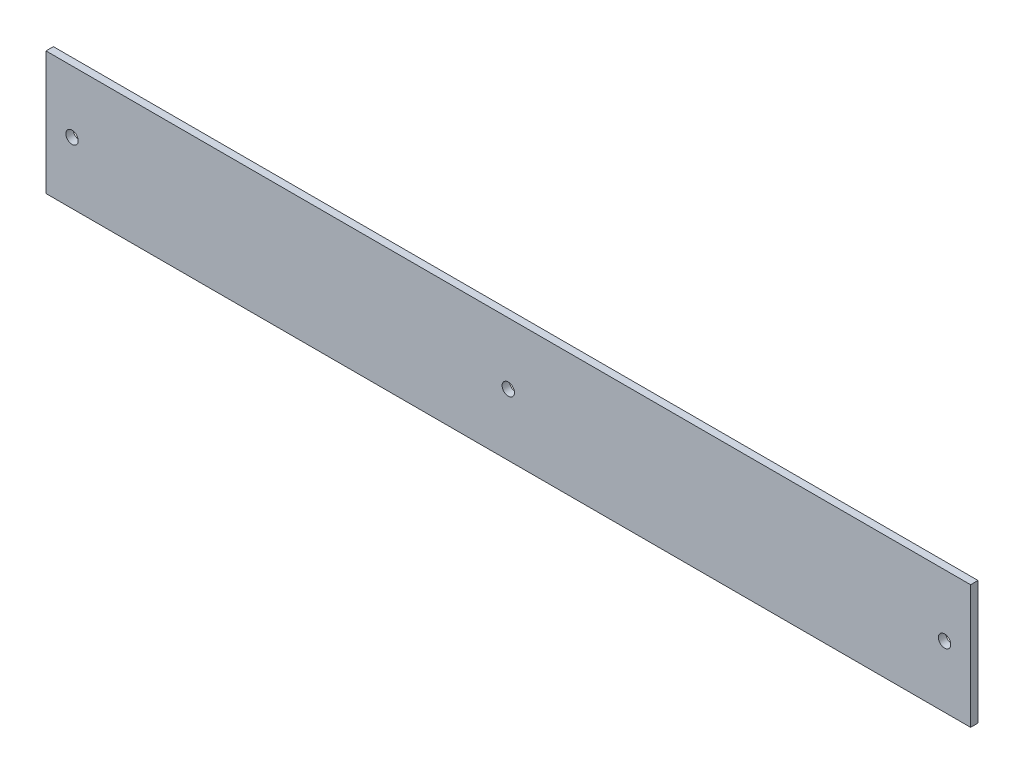
ISO-10303-21;
HEADER;
FILE_DESCRIPTION(('STEP AP214'),'2;1');
FILE_NAME('part.step','',(''),(''),'','','');
FILE_SCHEMA(('AUTOMOTIVE_DESIGN { 1 0 10303 214 1 1 1 1 }'));
ENDSEC;
DATA;
#1=APPLICATION_CONTEXT('core data for automotive mechanical design processes');
#2=APPLICATION_PROTOCOL_DEFINITION('international standard','automotive_design',2000,#1);
#3=PRODUCT_CONTEXT('',#1,'mechanical');
#4=PRODUCT('Part','Part','',(#3));
#5=PRODUCT_RELATED_PRODUCT_CATEGORY('part','',(#4));
#6=PRODUCT_DEFINITION_FORMATION('','',#4);
#7=PRODUCT_DEFINITION_CONTEXT('part definition',#1,'design');
#8=PRODUCT_DEFINITION('design','',#6,#7);
#9=PRODUCT_DEFINITION_SHAPE('','',#8);
#10=(LENGTH_UNIT() NAMED_UNIT(*) SI_UNIT(.MILLI.,.METRE.));
#11=(NAMED_UNIT(*) PLANE_ANGLE_UNIT() SI_UNIT($,.RADIAN.));
#12=(NAMED_UNIT(*) SI_UNIT($,.STERADIAN.) SOLID_ANGLE_UNIT());
#13=UNCERTAINTY_MEASURE_WITH_UNIT(LENGTH_MEASURE(1.E-05),#10,'distance_accuracy_value','');
#14=(GEOMETRIC_REPRESENTATION_CONTEXT(3) GLOBAL_UNCERTAINTY_ASSIGNED_CONTEXT((#13)) GLOBAL_UNIT_ASSIGNED_CONTEXT((#10,
#11,#12)) REPRESENTATION_CONTEXT('',''));
#15=CARTESIAN_POINT('',(0.,0.,0.));
#16=DIRECTION('',(0.,0.,1.));
#17=DIRECTION('',(1.,0.,0.));
#18=AXIS2_PLACEMENT_3D('',#15,#16,#17);
#19=CARTESIAN_POINT('',(0.,0.,3.048));
#20=DIRECTION('',(0.,0.,-1.));
#21=DIRECTION('',(-1.,0.,0.));
#22=AXIS2_PLACEMENT_3D('',#19,#20,#21);
#23=PLANE('',#22);
#24=CARTESIAN_POINT('',(190.0936,25.4,3.048));
#25=DIRECTION('',(0.,0.,1.));
#26=DIRECTION('',(1.,0.,0.));
#27=AXIS2_PLACEMENT_3D('',#24,#25,#26);
#28=CIRCLE('',#27,2.53999999999998);
#29=CARTESIAN_POINT('',(192.6336,25.4,3.048));
#30=VERTEX_POINT('',#29);
#31=EDGE_CURVE('E115',#30,#30,#28,.T.);
#32=ORIENTED_EDGE('',*,*,#31,.F.);
#33=EDGE_LOOP('',(#32));
#34=FACE_BOUND('',#33,.T.);
#35=DIRECTION('',(0.,-1.,0.));
#36=VECTOR('',#35,1.);
#37=CARTESIAN_POINT('',(0.,0.,3.048));
#38=LINE('',#37,#36);
#39=CARTESIAN_POINT('',(0.,50.8,3.048));
#40=VERTEX_POINT('',#39);
#41=CARTESIAN_POINT('',(0.,0.,3.048));
#42=VERTEX_POINT('',#41);
#43=EDGE_CURVE('E85',#40,#42,#38,.T.);
#44=ORIENTED_EDGE('',*,*,#43,.T.);
#45=DIRECTION('',(1.,0.,0.));
#46=VECTOR('',#45,1.);
#47=CARTESIAN_POINT('',(0.,0.,3.048));
#48=LINE('',#47,#46);
#49=CARTESIAN_POINT('',(380.1872,0.,3.048));
#50=VERTEX_POINT('',#49);
#51=EDGE_CURVE('E80',#42,#50,#48,.T.);
#52=ORIENTED_EDGE('',*,*,#51,.T.);
#53=DIRECTION('',(0.,1.,0.));
#54=VECTOR('',#53,1.);
#55=CARTESIAN_POINT('',(380.1872,0.,3.048));
#56=LINE('',#55,#54);
#57=CARTESIAN_POINT('',(380.1872,50.8,3.048));
#58=VERTEX_POINT('',#57);
#59=EDGE_CURVE('E83',#50,#58,#56,.T.);
#60=ORIENTED_EDGE('',*,*,#59,.T.);
#61=DIRECTION('',(-1.,0.,0.));
#62=VECTOR('',#61,1.);
#63=CARTESIAN_POINT('',(0.,50.8,3.048));
#64=LINE('',#63,#62);
#65=EDGE_CURVE('E50',#58,#40,#64,.T.);
#66=ORIENTED_EDGE('',*,*,#65,.T.);
#67=EDGE_LOOP('',(#44,#52,#60,#66));
#68=FACE_BOUND('',#67,.T.);
#69=CARTESIAN_POINT('',(10.7061,25.4,3.048));
#70=DIRECTION('',(0.,0.,1.));
#71=DIRECTION('',(1.,0.,0.));
#72=AXIS2_PLACEMENT_3D('',#69,#70,#71);
#73=CIRCLE('',#72,2.54);
#74=CARTESIAN_POINT('',(13.2461,25.4,3.048));
#75=VERTEX_POINT('',#74);
#76=EDGE_CURVE('E100',#75,#75,#73,.T.);
#77=ORIENTED_EDGE('',*,*,#76,.F.);
#78=EDGE_LOOP('',(#77));
#79=FACE_BOUND('',#78,.T.);
#80=CARTESIAN_POINT('',(369.4811,25.4,3.048));
#81=DIRECTION('',(0.,0.,1.));
#82=DIRECTION('',(1.,0.,0.));
#83=AXIS2_PLACEMENT_3D('',#80,#81,#82);
#84=CIRCLE('',#83,2.54000000000001);
#85=CARTESIAN_POINT('',(372.0211,25.4,3.048));
#86=VERTEX_POINT('',#85);
#87=EDGE_CURVE('E121',#86,#86,#84,.T.);
#88=ORIENTED_EDGE('',*,*,#87,.F.);
#89=EDGE_LOOP('',(#88));
#90=FACE_BOUND('',#89,.T.);
#91=ADVANCED_FACE('F33',(#34,#68,#79,#90),#23,.F.);
#92=CARTESIAN_POINT('',(0.,0.,0.));
#93=DIRECTION('',(0.,0.,-1.));
#94=DIRECTION('',(-1.,0.,0.));
#95=AXIS2_PLACEMENT_3D('',#92,#93,#94);
#96=PLANE('',#95);
#97=CARTESIAN_POINT('',(190.0936,25.4,0.));
#98=DIRECTION('',(0.,0.,1.));
#99=DIRECTION('',(1.,0.,0.));
#100=AXIS2_PLACEMENT_3D('',#97,#98,#99);
#101=CIRCLE('',#100,2.53999999999998);
#102=CARTESIAN_POINT('',(192.6336,25.4,0.));
#103=VERTEX_POINT('',#102);
#104=EDGE_CURVE('E118',#103,#103,#101,.T.);
#105=ORIENTED_EDGE('',*,*,#104,.T.);
#106=EDGE_LOOP('',(#105));
#107=FACE_BOUND('',#106,.T.);
#108=DIRECTION('',(0.,-1.,0.));
#109=VECTOR('',#108,1.);
#110=CARTESIAN_POINT('',(0.,0.,0.));
#111=LINE('',#110,#109);
#112=CARTESIAN_POINT('',(0.,50.8,0.));
#113=VERTEX_POINT('',#112);
#114=CARTESIAN_POINT('',(0.,0.,0.));
#115=VERTEX_POINT('',#114);
#116=EDGE_CURVE('E97',#113,#115,#111,.T.);
#117=ORIENTED_EDGE('',*,*,#116,.F.);
#118=DIRECTION('',(-1.,0.,0.));
#119=VECTOR('',#118,1.);
#120=CARTESIAN_POINT('',(0.,50.8,0.));
#121=LINE('',#120,#119);
#122=CARTESIAN_POINT('',(380.1872,50.8,0.));
#123=VERTEX_POINT('',#122);
#124=EDGE_CURVE('E73',#123,#113,#121,.T.);
#125=ORIENTED_EDGE('',*,*,#124,.F.);
#126=DIRECTION('',(0.,1.,0.));
#127=VECTOR('',#126,1.);
#128=CARTESIAN_POINT('',(380.1872,0.,0.));
#129=LINE('',#128,#127);
#130=CARTESIAN_POINT('',(380.1872,0.,0.));
#131=VERTEX_POINT('',#130);
#132=EDGE_CURVE('E67',#131,#123,#129,.T.);
#133=ORIENTED_EDGE('',*,*,#132,.F.);
#134=DIRECTION('',(1.,0.,0.));
#135=VECTOR('',#134,1.);
#136=CARTESIAN_POINT('',(0.,0.,0.));
#137=LINE('',#136,#135);
#138=EDGE_CURVE('E89',#115,#131,#137,.T.);
#139=ORIENTED_EDGE('',*,*,#138,.F.);
#140=EDGE_LOOP('',(#117,#125,#133,#139));
#141=FACE_BOUND('',#140,.T.);
#142=CARTESIAN_POINT('',(10.7061,25.4,0.));
#143=DIRECTION('',(0.,0.,1.));
#144=DIRECTION('',(1.,0.,0.));
#145=AXIS2_PLACEMENT_3D('',#142,#143,#144);
#146=CIRCLE('',#145,2.54);
#147=CARTESIAN_POINT('',(13.2461,25.4,0.));
#148=VERTEX_POINT('',#147);
#149=EDGE_CURVE('E112',#148,#148,#146,.T.);
#150=ORIENTED_EDGE('',*,*,#149,.T.);
#151=EDGE_LOOP('',(#150));
#152=FACE_BOUND('',#151,.T.);
#153=CARTESIAN_POINT('',(369.4811,25.4,0.));
#154=DIRECTION('',(0.,0.,1.));
#155=DIRECTION('',(1.,0.,0.));
#156=AXIS2_PLACEMENT_3D('',#153,#154,#155);
#157=CIRCLE('',#156,2.54000000000001);
#158=CARTESIAN_POINT('',(372.0211,25.4,0.));
#159=VERTEX_POINT('',#158);
#160=EDGE_CURVE('E124',#159,#159,#157,.T.);
#161=ORIENTED_EDGE('',*,*,#160,.T.);
#162=EDGE_LOOP('',(#161));
#163=FACE_BOUND('',#162,.T.);
#164=ADVANCED_FACE('F108',(#107,#141,#152,#163),#96,.T.);
#165=CARTESIAN_POINT('',(0.,0.,3.048));
#166=DIRECTION('',(1.,0.,0.));
#167=DIRECTION('',(0.,0.,-1.));
#168=AXIS2_PLACEMENT_3D('',#165,#166,#167);
#169=PLANE('',#168);
#170=ORIENTED_EDGE('',*,*,#116,.T.);
#171=DIRECTION('',(0.,0.,-1.));
#172=VECTOR('',#171,1.);
#173=CARTESIAN_POINT('',(0.,0.,3.048));
#174=LINE('',#173,#172);
#175=EDGE_CURVE('E11',#42,#115,#174,.T.);
#176=ORIENTED_EDGE('',*,*,#175,.F.);
#177=ORIENTED_EDGE('',*,*,#43,.F.);
#178=DIRECTION('',(0.,0.,-1.));
#179=VECTOR('',#178,1.);
#180=CARTESIAN_POINT('',(0.,50.8,3.048));
#181=LINE('',#180,#179);
#182=EDGE_CURVE('E93',#40,#113,#181,.T.);
#183=ORIENTED_EDGE('',*,*,#182,.T.);
#184=EDGE_LOOP('',(#170,#176,#177,#183));
#185=FACE_BOUND('',#184,.T.);
#186=ADVANCED_FACE('F35',(#185),#169,.F.);
#187=CARTESIAN_POINT('',(0.,0.,3.048));
#188=DIRECTION('',(0.,1.,0.));
#189=DIRECTION('',(0.,0.,1.));
#190=AXIS2_PLACEMENT_3D('',#187,#188,#189);
#191=PLANE('',#190);
#192=ORIENTED_EDGE('',*,*,#138,.T.);
#193=DIRECTION('',(0.,0.,-1.));
#194=VECTOR('',#193,1.);
#195=CARTESIAN_POINT('',(380.1872,0.,3.048));
#196=LINE('',#195,#194);
#197=EDGE_CURVE('E42',#50,#131,#196,.T.);
#198=ORIENTED_EDGE('',*,*,#197,.F.);
#199=ORIENTED_EDGE('',*,*,#51,.F.);
#200=ORIENTED_EDGE('',*,*,#175,.T.);
#201=EDGE_LOOP('',(#192,#198,#199,#200));
#202=FACE_BOUND('',#201,.T.);
#203=ADVANCED_FACE('F88',(#202),#191,.F.);
#204=CARTESIAN_POINT('',(380.1872,0.,3.048));
#205=DIRECTION('',(-1.,0.,0.));
#206=DIRECTION('',(0.,0.,1.));
#207=AXIS2_PLACEMENT_3D('',#204,#205,#206);
#208=PLANE('',#207);
#209=ORIENTED_EDGE('',*,*,#132,.T.);
#210=DIRECTION('',(0.,0.,-1.));
#211=VECTOR('',#210,1.);
#212=CARTESIAN_POINT('',(380.1872,50.8,3.048));
#213=LINE('',#212,#211);
#214=EDGE_CURVE('E90',#58,#123,#213,.T.);
#215=ORIENTED_EDGE('',*,*,#214,.F.);
#216=ORIENTED_EDGE('',*,*,#59,.F.);
#217=ORIENTED_EDGE('',*,*,#197,.T.);
#218=EDGE_LOOP('',(#209,#215,#216,#217));
#219=FACE_BOUND('',#218,.T.);
#220=ADVANCED_FACE('F91',(#219),#208,.F.);
#221=CARTESIAN_POINT('',(0.,50.8,3.048));
#222=DIRECTION('',(0.,-1.,0.));
#223=DIRECTION('',(0.,0.,-1.));
#224=AXIS2_PLACEMENT_3D('',#221,#222,#223);
#225=PLANE('',#224);
#226=ORIENTED_EDGE('',*,*,#124,.T.);
#227=ORIENTED_EDGE('',*,*,#182,.F.);
#228=ORIENTED_EDGE('',*,*,#65,.F.);
#229=ORIENTED_EDGE('',*,*,#214,.T.);
#230=EDGE_LOOP('',(#226,#227,#228,#229));
#231=FACE_BOUND('',#230,.T.);
#232=ADVANCED_FACE('F105',(#231),#225,.F.);
#233=CARTESIAN_POINT('',(10.7061,25.4,3.048));
#234=DIRECTION('',(0.,0.,-1.));
#235=DIRECTION('',(-1.,0.,0.));
#236=AXIS2_PLACEMENT_3D('',#233,#234,#235);
#237=CYLINDRICAL_SURFACE('',#236,2.54);
#238=ORIENTED_EDGE('',*,*,#76,.T.);
#239=EDGE_LOOP('',(#238));
#240=FACE_BOUND('',#239,.T.);
#241=ORIENTED_EDGE('',*,*,#149,.F.);
#242=EDGE_LOOP('',(#241));
#243=FACE_BOUND('',#242,.T.);
#244=ADVANCED_FACE('F143',(#240,#243),#237,.F.);
#245=CARTESIAN_POINT('',(190.0936,25.4,3.048));
#246=DIRECTION('',(0.,0.,-1.));
#247=DIRECTION('',(-1.,0.,0.));
#248=AXIS2_PLACEMENT_3D('',#245,#246,#247);
#249=CYLINDRICAL_SURFACE('',#248,2.53999999999998);
#250=ORIENTED_EDGE('',*,*,#31,.T.);
#251=EDGE_LOOP('',(#250));
#252=FACE_BOUND('',#251,.T.);
#253=ORIENTED_EDGE('',*,*,#104,.F.);
#254=EDGE_LOOP('',(#253));
#255=FACE_BOUND('',#254,.T.);
#256=ADVANCED_FACE('F189',(#252,#255),#249,.F.);
#257=CARTESIAN_POINT('',(369.4811,25.4,3.048));
#258=DIRECTION('',(0.,0.,-1.));
#259=DIRECTION('',(-1.,0.,0.));
#260=AXIS2_PLACEMENT_3D('',#257,#258,#259);
#261=CYLINDRICAL_SURFACE('',#260,2.54000000000001);
#262=ORIENTED_EDGE('',*,*,#87,.T.);
#263=EDGE_LOOP('',(#262));
#264=FACE_BOUND('',#263,.T.);
#265=ORIENTED_EDGE('',*,*,#160,.F.);
#266=EDGE_LOOP('',(#265));
#267=FACE_BOUND('',#266,.T.);
#268=ADVANCED_FACE('F130',(#264,#267),#261,.F.);
#269=CLOSED_SHELL('',(#91,#164,#186,#203,#220,#232,#244,#256,#268));
#270=MANIFOLD_SOLID_BREP('B2',#269);
#271=ADVANCED_BREP_SHAPE_REPRESENTATION('',(#18,#270),#14);
#272=SHAPE_DEFINITION_REPRESENTATION(#9,#271);
ENDSEC;
END-ISO-10303-21;
